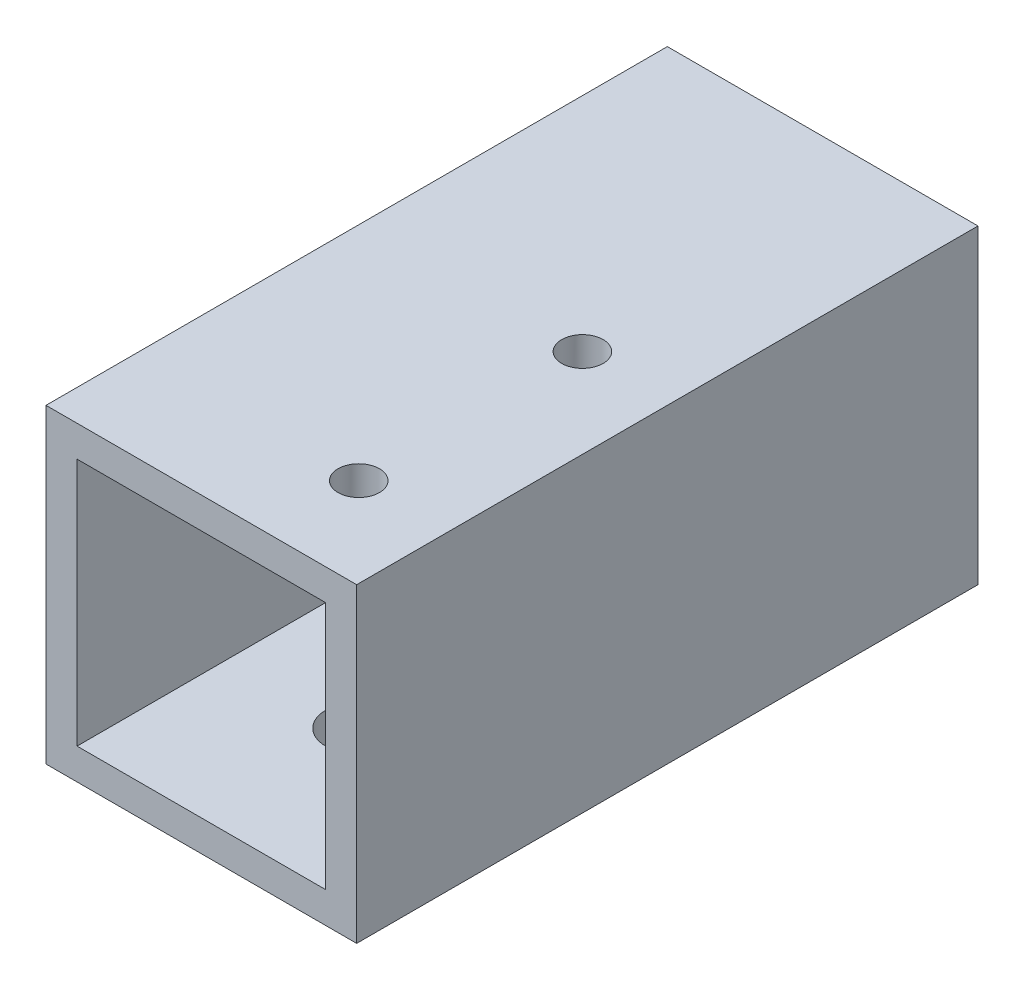
ISO-10303-21;
HEADER;
FILE_DESCRIPTION(('STEP AP214'),'2;1');
FILE_NAME('part.step','',(''),(''),'','','');
FILE_SCHEMA(('AUTOMOTIVE_DESIGN { 1 0 10303 214 1 1 1 1 }'));
ENDSEC;
DATA;
#1=APPLICATION_CONTEXT('core data for automotive mechanical design processes');
#2=APPLICATION_PROTOCOL_DEFINITION('international standard','automotive_design',2000,#1);
#3=PRODUCT_CONTEXT('',#1,'mechanical');
#4=PRODUCT('Part','Part','',(#3));
#5=PRODUCT_RELATED_PRODUCT_CATEGORY('part','',(#4));
#6=PRODUCT_DEFINITION_FORMATION('','',#4);
#7=PRODUCT_DEFINITION_CONTEXT('part definition',#1,'design');
#8=PRODUCT_DEFINITION('design','',#6,#7);
#9=PRODUCT_DEFINITION_SHAPE('','',#8);
#10=(LENGTH_UNIT() NAMED_UNIT(*) SI_UNIT(.MILLI.,.METRE.));
#11=(NAMED_UNIT(*) PLANE_ANGLE_UNIT() SI_UNIT($,.RADIAN.));
#12=(NAMED_UNIT(*) SI_UNIT($,.STERADIAN.) SOLID_ANGLE_UNIT());
#13=UNCERTAINTY_MEASURE_WITH_UNIT(LENGTH_MEASURE(1.E-05),#10,'distance_accuracy_value','');
#14=(GEOMETRIC_REPRESENTATION_CONTEXT(3) GLOBAL_UNCERTAINTY_ASSIGNED_CONTEXT((#13)) GLOBAL_UNIT_ASSIGNED_CONTEXT((#10,
#11,#12)) REPRESENTATION_CONTEXT('',''));
#15=CARTESIAN_POINT('',(0.,0.,0.));
#16=DIRECTION('',(0.,0.,1.));
#17=DIRECTION('',(1.,0.,0.));
#18=AXIS2_PLACEMENT_3D('',#15,#16,#17);
#19=CARTESIAN_POINT('',(0.,0.,30.));
#20=DIRECTION('',(0.,0.,1.));
#21=DIRECTION('',(1.,0.,0.));
#22=AXIS2_PLACEMENT_3D('',#19,#20,#21);
#23=PLANE('',#22);
#24=DIRECTION('',(0.,-1.,0.));
#25=VECTOR('',#24,1.);
#26=CARTESIAN_POINT('',(-7.01008414074451,7.73262608579252,30.));
#27=LINE('',#26,#25);
#28=CARTESIAN_POINT('',(-7.01008414074451,7.73262608579252,30.));
#29=VERTEX_POINT('',#28);
#30=CARTESIAN_POINT('',(-7.01008414074451,-7.26737391420748,30.));
#31=VERTEX_POINT('',#30);
#32=EDGE_CURVE('E138',#29,#31,#27,.T.);
#33=ORIENTED_EDGE('',*,*,#32,.T.);
#34=DIRECTION('',(1.,0.,0.));
#35=VECTOR('',#34,1.);
#36=CARTESIAN_POINT('',(-7.01008414074451,-7.26737391420748,30.));
#37=LINE('',#36,#35);
#38=CARTESIAN_POINT('',(7.98991585925548,-7.26737391420748,30.));
#39=VERTEX_POINT('',#38);
#40=EDGE_CURVE('E141',#31,#39,#37,.T.);
#41=ORIENTED_EDGE('',*,*,#40,.T.);
#42=DIRECTION('',(0.,1.,0.));
#43=VECTOR('',#42,1.);
#44=CARTESIAN_POINT('',(7.98991585925549,7.73262608579252,30.));
#45=LINE('',#44,#43);
#46=CARTESIAN_POINT('',(7.98991585925549,7.73262608579252,30.));
#47=VERTEX_POINT('',#46);
#48=EDGE_CURVE('E144',#39,#47,#45,.T.);
#49=ORIENTED_EDGE('',*,*,#48,.T.);
#50=DIRECTION('',(-1.,0.,0.));
#51=VECTOR('',#50,1.);
#52=CARTESIAN_POINT('',(-7.01008414074451,7.73262608579252,30.));
#53=LINE('',#52,#51);
#54=EDGE_CURVE('E146',#47,#29,#53,.T.);
#55=ORIENTED_EDGE('',*,*,#54,.T.);
#56=EDGE_LOOP('',(#33,#41,#49,#55));
#57=FACE_BOUND('',#56,.T.);
#58=DIRECTION('',(1.,0.,0.));
#59=VECTOR('',#58,1.);
#60=CARTESIAN_POINT('',(-5.51008414074451,-5.76737391420748,30.));
#61=LINE('',#60,#59);
#62=CARTESIAN_POINT('',(-5.51008414074451,-5.76737391420748,30.));
#63=VERTEX_POINT('',#62);
#64=CARTESIAN_POINT('',(6.48991585925549,-5.76737391420748,30.));
#65=VERTEX_POINT('',#64);
#66=EDGE_CURVE('E108',#63,#65,#61,.T.);
#67=ORIENTED_EDGE('',*,*,#66,.F.);
#68=DIRECTION('',(0.,-1.,0.));
#69=VECTOR('',#68,1.);
#70=CARTESIAN_POINT('',(-5.51008414074451,6.23262608579252,30.));
#71=LINE('',#70,#69);
#72=CARTESIAN_POINT('',(-5.51008414074451,6.23262608579252,30.));
#73=VERTEX_POINT('',#72);
#74=EDGE_CURVE('E100',#73,#63,#71,.T.);
#75=ORIENTED_EDGE('',*,*,#74,.F.);
#76=DIRECTION('',(-1.,0.,0.));
#77=VECTOR('',#76,1.);
#78=CARTESIAN_POINT('',(-5.51008414074451,6.23262608579252,30.));
#79=LINE('',#78,#77);
#80=CARTESIAN_POINT('',(6.48991585925549,6.23262608579252,30.));
#81=VERTEX_POINT('',#80);
#82=EDGE_CURVE('E122',#81,#73,#79,.T.);
#83=ORIENTED_EDGE('',*,*,#82,.F.);
#84=DIRECTION('',(0.,1.,0.));
#85=VECTOR('',#84,1.);
#86=CARTESIAN_POINT('',(6.48991585925549,6.23262608579252,30.));
#87=LINE('',#86,#85);
#88=EDGE_CURVE('E120',#65,#81,#87,.T.);
#89=ORIENTED_EDGE('',*,*,#88,.F.);
#90=EDGE_LOOP('',(#67,#75,#83,#89));
#91=FACE_BOUND('',#90,.T.);
#92=ADVANCED_FACE('F33',(#57,#91),#23,.T.);
#93=CARTESIAN_POINT('',(0.,0.,0.));
#94=DIRECTION('',(0.,0.,1.));
#95=DIRECTION('',(1.,0.,0.));
#96=AXIS2_PLACEMENT_3D('',#93,#94,#95);
#97=PLANE('',#96);
#98=DIRECTION('',(0.,-1.,0.));
#99=VECTOR('',#98,1.);
#100=CARTESIAN_POINT('',(-7.01008414074451,7.73262608579252,0.));
#101=LINE('',#100,#99);
#102=CARTESIAN_POINT('',(-7.01008414074451,7.73262608579252,0.));
#103=VERTEX_POINT('',#102);
#104=CARTESIAN_POINT('',(-7.01008414074451,-7.26737391420748,0.));
#105=VERTEX_POINT('',#104);
#106=EDGE_CURVE('E116',#103,#105,#101,.T.);
#107=ORIENTED_EDGE('',*,*,#106,.F.);
#108=DIRECTION('',(-1.,0.,0.));
#109=VECTOR('',#108,1.);
#110=CARTESIAN_POINT('',(-7.01008414074451,7.73262608579252,0.));
#111=LINE('',#110,#109);
#112=CARTESIAN_POINT('',(7.98991585925549,7.73262608579252,0.));
#113=VERTEX_POINT('',#112);
#114=EDGE_CURVE('E142',#113,#103,#111,.T.);
#115=ORIENTED_EDGE('',*,*,#114,.F.);
#116=DIRECTION('',(0.,1.,0.));
#117=VECTOR('',#116,1.);
#118=CARTESIAN_POINT('',(7.98991585925549,7.73262608579252,0.));
#119=LINE('',#118,#117);
#120=CARTESIAN_POINT('',(7.98991585925548,-7.26737391420748,0.));
#121=VERTEX_POINT('',#120);
#122=EDGE_CURVE('E153',#121,#113,#119,.T.);
#123=ORIENTED_EDGE('',*,*,#122,.F.);
#124=DIRECTION('',(1.,0.,0.));
#125=VECTOR('',#124,1.);
#126=CARTESIAN_POINT('',(-7.01008414074451,-7.26737391420748,0.));
#127=LINE('',#126,#125);
#128=EDGE_CURVE('E151',#105,#121,#127,.T.);
#129=ORIENTED_EDGE('',*,*,#128,.F.);
#130=EDGE_LOOP('',(#107,#115,#123,#129));
#131=FACE_BOUND('',#130,.T.);
#132=DIRECTION('',(0.,-1.,0.));
#133=VECTOR('',#132,1.);
#134=CARTESIAN_POINT('',(-5.51008414074451,6.23262608579252,0.));
#135=LINE('',#134,#133);
#136=CARTESIAN_POINT('',(-5.51008414074451,6.23262608579252,0.));
#137=VERTEX_POINT('',#136);
#138=CARTESIAN_POINT('',(-5.51008414074451,-5.76737391420748,0.));
#139=VERTEX_POINT('',#138);
#140=EDGE_CURVE('E58',#137,#139,#135,.T.);
#141=ORIENTED_EDGE('',*,*,#140,.T.);
#142=DIRECTION('',(1.,0.,0.));
#143=VECTOR('',#142,1.);
#144=CARTESIAN_POINT('',(-5.51008414074451,-5.76737391420748,0.));
#145=LINE('',#144,#143);
#146=CARTESIAN_POINT('',(6.48991585925549,-5.76737391420748,0.));
#147=VERTEX_POINT('',#146);
#148=EDGE_CURVE('E115',#139,#147,#145,.T.);
#149=ORIENTED_EDGE('',*,*,#148,.T.);
#150=DIRECTION('',(0.,1.,0.));
#151=VECTOR('',#150,1.);
#152=CARTESIAN_POINT('',(6.48991585925549,6.23262608579252,0.));
#153=LINE('',#152,#151);
#154=CARTESIAN_POINT('',(6.48991585925549,6.23262608579252,0.));
#155=VERTEX_POINT('',#154);
#156=EDGE_CURVE('E130',#147,#155,#153,.T.);
#157=ORIENTED_EDGE('',*,*,#156,.T.);
#158=DIRECTION('',(-1.,0.,0.));
#159=VECTOR('',#158,1.);
#160=CARTESIAN_POINT('',(-5.51008414074451,6.23262608579252,0.));
#161=LINE('',#160,#159);
#162=EDGE_CURVE('E109',#155,#137,#161,.T.);
#163=ORIENTED_EDGE('',*,*,#162,.T.);
#164=EDGE_LOOP('',(#141,#149,#157,#163));
#165=FACE_BOUND('',#164,.T.);
#166=ADVANCED_FACE('F205',(#131,#165),#97,.F.);
#167=CARTESIAN_POINT('',(-7.01008414074451,7.73262608579252,30.));
#168=DIRECTION('',(1.,0.,0.));
#169=DIRECTION('',(0.,1.,0.));
#170=AXIS2_PLACEMENT_3D('',#167,#168,#169);
#171=PLANE('',#170);
#172=CARTESIAN_POINT('',(-7.01008414074451,0.232626085792518,7.5));
#173=DIRECTION('',(-1.,0.,0.));
#174=DIRECTION('',(0.,-1.,0.));
#175=AXIS2_PLACEMENT_3D('',#172,#173,#174);
#176=CIRCLE('',#175,1.5);
#177=CARTESIAN_POINT('',(-7.01008414074451,-1.26737391420748,7.5));
#178=VERTEX_POINT('',#177);
#179=EDGE_CURVE('E171',#178,#178,#176,.T.);
#180=ORIENTED_EDGE('',*,*,#179,.F.);
#181=EDGE_LOOP('',(#180));
#182=FACE_BOUND('',#181,.T.);
#183=ORIENTED_EDGE('',*,*,#106,.T.);
#184=DIRECTION('',(0.,0.,-1.));
#185=VECTOR('',#184,1.);
#186=CARTESIAN_POINT('',(-7.01008414074451,-7.26737391420748,30.));
#187=LINE('',#186,#185);
#188=EDGE_CURVE('E11',#31,#105,#187,.T.);
#189=ORIENTED_EDGE('',*,*,#188,.F.);
#190=ORIENTED_EDGE('',*,*,#32,.F.);
#191=DIRECTION('',(0.,0.,-1.));
#192=VECTOR('',#191,1.);
#193=CARTESIAN_POINT('',(-7.01008414074451,7.73262608579252,30.));
#194=LINE('',#193,#192);
#195=EDGE_CURVE('E148',#29,#103,#194,.T.);
#196=ORIENTED_EDGE('',*,*,#195,.T.);
#197=EDGE_LOOP('',(#183,#189,#190,#196));
#198=FACE_BOUND('',#197,.T.);
#199=ADVANCED_FACE('F35',(#182,#198),#171,.F.);
#200=CARTESIAN_POINT('',(-7.01008414074451,-7.26737391420748,30.));
#201=DIRECTION('',(0.,1.,0.));
#202=DIRECTION('',(0.,0.,1.));
#203=AXIS2_PLACEMENT_3D('',#200,#201,#202);
#204=PLANE('',#203);
#205=CARTESIAN_POINT('',(0.489915859255484,-7.26737391420748,22.5));
#206=DIRECTION('',(0.,-1.,0.));
#207=DIRECTION('',(0.,0.,-1.));
#208=AXIS2_PLACEMENT_3D('',#205,#206,#207);
#209=CIRCLE('',#208,1.5);
#210=CARTESIAN_POINT('',(0.489915859255484,-7.26737391420748,21.));
#211=VERTEX_POINT('',#210);
#212=EDGE_CURVE('E180',#211,#211,#209,.T.);
#213=ORIENTED_EDGE('',*,*,#212,.F.);
#214=EDGE_LOOP('',(#213));
#215=FACE_BOUND('',#214,.T.);
#216=ORIENTED_EDGE('',*,*,#128,.T.);
#217=DIRECTION('',(0.,0.,-1.));
#218=VECTOR('',#217,1.);
#219=CARTESIAN_POINT('',(7.98991585925548,-7.26737391420748,30.));
#220=LINE('',#219,#218);
#221=EDGE_CURVE('E42',#39,#121,#220,.T.);
#222=ORIENTED_EDGE('',*,*,#221,.F.);
#223=ORIENTED_EDGE('',*,*,#40,.F.);
#224=ORIENTED_EDGE('',*,*,#188,.T.);
#225=EDGE_LOOP('',(#216,#222,#223,#224));
#226=FACE_BOUND('',#225,.T.);
#227=ADVANCED_FACE('F209',(#215,#226),#204,.F.);
#228=CARTESIAN_POINT('',(7.98991585925549,7.73262608579252,30.));
#229=DIRECTION('',(-1.,0.,0.));
#230=DIRECTION('',(0.,-1.,0.));
#231=AXIS2_PLACEMENT_3D('',#228,#229,#230);
#232=PLANE('',#231);
#233=ORIENTED_EDGE('',*,*,#122,.T.);
#234=DIRECTION('',(0.,0.,-1.));
#235=VECTOR('',#234,1.);
#236=CARTESIAN_POINT('',(7.98991585925549,7.73262608579252,30.));
#237=LINE('',#236,#235);
#238=EDGE_CURVE('E158',#47,#113,#237,.T.);
#239=ORIENTED_EDGE('',*,*,#238,.F.);
#240=ORIENTED_EDGE('',*,*,#48,.F.);
#241=ORIENTED_EDGE('',*,*,#221,.T.);
#242=EDGE_LOOP('',(#233,#239,#240,#241));
#243=FACE_BOUND('',#242,.T.);
#244=ADVANCED_FACE('F191',(#243),#232,.F.);
#245=CARTESIAN_POINT('',(-7.01008414074451,7.73262608579252,30.));
#246=DIRECTION('',(0.,-1.,0.));
#247=DIRECTION('',(0.,0.,-1.));
#248=AXIS2_PLACEMENT_3D('',#245,#246,#247);
#249=PLANE('',#248);
#250=CARTESIAN_POINT('',(3.68991585925549,7.73262608579252,25.6));
#251=DIRECTION('',(0.,1.,0.));
#252=DIRECTION('',(0.,0.,1.));
#253=AXIS2_PLACEMENT_3D('',#250,#251,#252);
#254=CIRCLE('',#253,1.);
#255=CARTESIAN_POINT('',(3.68991585925549,7.73262608579252,26.6));
#256=VERTEX_POINT('',#255);
#257=EDGE_CURVE('E166',#256,#256,#254,.T.);
#258=ORIENTED_EDGE('',*,*,#257,.F.);
#259=EDGE_LOOP('',(#258));
#260=FACE_BOUND('',#259,.T.);
#261=CARTESIAN_POINT('',(3.68991585925549,7.73262608579252,14.8));
#262=DIRECTION('',(0.,1.,0.));
#263=DIRECTION('',(0.,0.,1.));
#264=AXIS2_PLACEMENT_3D('',#261,#262,#263);
#265=CIRCLE('',#264,1.);
#266=CARTESIAN_POINT('',(3.68991585925549,7.73262608579252,15.8));
#267=VERTEX_POINT('',#266);
#268=EDGE_CURVE('E170',#267,#267,#265,.T.);
#269=ORIENTED_EDGE('',*,*,#268,.F.);
#270=EDGE_LOOP('',(#269));
#271=FACE_BOUND('',#270,.T.);
#272=ORIENTED_EDGE('',*,*,#114,.T.);
#273=ORIENTED_EDGE('',*,*,#195,.F.);
#274=ORIENTED_EDGE('',*,*,#54,.F.);
#275=ORIENTED_EDGE('',*,*,#238,.T.);
#276=EDGE_LOOP('',(#272,#273,#274,#275));
#277=FACE_BOUND('',#276,.T.);
#278=ADVANCED_FACE('F188',(#260,#271,#277),#249,.F.);
#279=CARTESIAN_POINT('',(-5.51008414074451,6.23262608579252,30.));
#280=DIRECTION('',(1.,0.,0.));
#281=DIRECTION('',(0.,1.,0.));
#282=AXIS2_PLACEMENT_3D('',#279,#280,#281);
#283=PLANE('',#282);
#284=CARTESIAN_POINT('',(-5.51008414074451,0.232626085792519,7.5));
#285=DIRECTION('',(1.,0.,0.));
#286=DIRECTION('',(0.,1.,0.));
#287=AXIS2_PLACEMENT_3D('',#284,#285,#286);
#288=CIRCLE('',#287,1.5);
#289=CARTESIAN_POINT('',(-5.51008414074451,1.73262608579252,7.5));
#290=VERTEX_POINT('',#289);
#291=EDGE_CURVE('E168',#290,#290,#288,.T.);
#292=ORIENTED_EDGE('',*,*,#291,.F.);
#293=EDGE_LOOP('',(#292));
#294=FACE_BOUND('',#293,.T.);
#295=ORIENTED_EDGE('',*,*,#140,.F.);
#296=DIRECTION('',(0.,0.,-1.));
#297=VECTOR('',#296,1.);
#298=CARTESIAN_POINT('',(-5.51008414074451,6.23262608579252,30.));
#299=LINE('',#298,#297);
#300=EDGE_CURVE('E104',#73,#137,#299,.T.);
#301=ORIENTED_EDGE('',*,*,#300,.F.);
#302=ORIENTED_EDGE('',*,*,#74,.T.);
#303=DIRECTION('',(0.,0.,-1.));
#304=VECTOR('',#303,1.);
#305=CARTESIAN_POINT('',(-5.51008414074451,-5.76737391420748,30.));
#306=LINE('',#305,#304);
#307=EDGE_CURVE('E103',#63,#139,#306,.T.);
#308=ORIENTED_EDGE('',*,*,#307,.T.);
#309=EDGE_LOOP('',(#295,#301,#302,#308));
#310=FACE_BOUND('',#309,.T.);
#311=ADVANCED_FACE('F102',(#294,#310),#283,.T.);
#312=CARTESIAN_POINT('',(-5.51008414074451,-5.76737391420748,30.));
#313=DIRECTION('',(0.,1.,0.));
#314=DIRECTION('',(0.,0.,1.));
#315=AXIS2_PLACEMENT_3D('',#312,#313,#314);
#316=PLANE('',#315);
#317=CARTESIAN_POINT('',(0.489915859255484,-5.76737391420748,22.5));
#318=DIRECTION('',(0.,1.,0.));
#319=DIRECTION('',(0.,0.,1.));
#320=AXIS2_PLACEMENT_3D('',#317,#318,#319);
#321=CIRCLE('',#320,1.5);
#322=CARTESIAN_POINT('',(0.489915859255484,-5.76737391420748,24.));
#323=VERTEX_POINT('',#322);
#324=EDGE_CURVE('E37',#323,#323,#321,.T.);
#325=ORIENTED_EDGE('',*,*,#324,.F.);
#326=EDGE_LOOP('',(#325));
#327=FACE_BOUND('',#326,.T.);
#328=ORIENTED_EDGE('',*,*,#148,.F.);
#329=ORIENTED_EDGE('',*,*,#307,.F.);
#330=ORIENTED_EDGE('',*,*,#66,.T.);
#331=DIRECTION('',(0.,0.,-1.));
#332=VECTOR('',#331,1.);
#333=CARTESIAN_POINT('',(6.48991585925549,-5.76737391420748,30.));
#334=LINE('',#333,#332);
#335=EDGE_CURVE('E117',#65,#147,#334,.T.);
#336=ORIENTED_EDGE('',*,*,#335,.T.);
#337=EDGE_LOOP('',(#328,#329,#330,#336));
#338=FACE_BOUND('',#337,.T.);
#339=ADVANCED_FACE('F112',(#327,#338),#316,.T.);
#340=CARTESIAN_POINT('',(6.48991585925549,6.23262608579252,30.));
#341=DIRECTION('',(-1.,0.,0.));
#342=DIRECTION('',(0.,-1.,0.));
#343=AXIS2_PLACEMENT_3D('',#340,#341,#342);
#344=PLANE('',#343);
#345=ORIENTED_EDGE('',*,*,#156,.F.);
#346=ORIENTED_EDGE('',*,*,#335,.F.);
#347=ORIENTED_EDGE('',*,*,#88,.T.);
#348=DIRECTION('',(0.,0.,-1.));
#349=VECTOR('',#348,1.);
#350=CARTESIAN_POINT('',(6.48991585925549,6.23262608579252,30.));
#351=LINE('',#350,#349);
#352=EDGE_CURVE('E50',#81,#155,#351,.T.);
#353=ORIENTED_EDGE('',*,*,#352,.T.);
#354=EDGE_LOOP('',(#345,#346,#347,#353));
#355=FACE_BOUND('',#354,.T.);
#356=ADVANCED_FACE('F231',(#355),#344,.T.);
#357=CARTESIAN_POINT('',(-5.51008414074451,6.23262608579252,30.));
#358=DIRECTION('',(0.,-1.,0.));
#359=DIRECTION('',(0.,0.,-1.));
#360=AXIS2_PLACEMENT_3D('',#357,#358,#359);
#361=PLANE('',#360);
#362=CARTESIAN_POINT('',(3.68991585925549,6.23262608579252,25.6));
#363=DIRECTION('',(0.,-1.,0.));
#364=DIRECTION('',(0.,0.,-1.));
#365=AXIS2_PLACEMENT_3D('',#362,#363,#364);
#366=CIRCLE('',#365,1.);
#367=CARTESIAN_POINT('',(3.68991585925549,6.23262608579252,24.6));
#368=VERTEX_POINT('',#367);
#369=EDGE_CURVE('E128',#368,#368,#366,.T.);
#370=ORIENTED_EDGE('',*,*,#369,.F.);
#371=EDGE_LOOP('',(#370));
#372=FACE_BOUND('',#371,.T.);
#373=CARTESIAN_POINT('',(3.68991585925549,6.23262608579252,14.8));
#374=DIRECTION('',(0.,-1.,0.));
#375=DIRECTION('',(0.,0.,-1.));
#376=AXIS2_PLACEMENT_3D('',#373,#374,#375);
#377=CIRCLE('',#376,1.);
#378=CARTESIAN_POINT('',(3.68991585925549,6.23262608579252,13.8));
#379=VERTEX_POINT('',#378);
#380=EDGE_CURVE('E163',#379,#379,#377,.T.);
#381=ORIENTED_EDGE('',*,*,#380,.F.);
#382=EDGE_LOOP('',(#381));
#383=FACE_BOUND('',#382,.T.);
#384=ORIENTED_EDGE('',*,*,#162,.F.);
#385=ORIENTED_EDGE('',*,*,#352,.F.);
#386=ORIENTED_EDGE('',*,*,#82,.T.);
#387=ORIENTED_EDGE('',*,*,#300,.T.);
#388=EDGE_LOOP('',(#384,#385,#386,#387));
#389=FACE_BOUND('',#388,.T.);
#390=ADVANCED_FACE('F235',(#372,#383,#389),#361,.T.);
#391=CARTESIAN_POINT('',(3.68991585925549,-2.26737391420748,14.8));
#392=DIRECTION('',(0.,1.,0.));
#393=DIRECTION('',(0.,0.,1.));
#394=AXIS2_PLACEMENT_3D('',#391,#392,#393);
#395=CYLINDRICAL_SURFACE('',#394,1.);
#396=ORIENTED_EDGE('',*,*,#380,.T.);
#397=EDGE_LOOP('',(#396));
#398=FACE_BOUND('',#397,.T.);
#399=ORIENTED_EDGE('',*,*,#268,.T.);
#400=EDGE_LOOP('',(#399));
#401=FACE_BOUND('',#400,.T.);
#402=ADVANCED_FACE('F239',(#398,#401),#395,.F.);
#403=CARTESIAN_POINT('',(3.68991585925549,-2.26737391420748,25.6));
#404=DIRECTION('',(0.,1.,0.));
#405=DIRECTION('',(0.,0.,1.));
#406=AXIS2_PLACEMENT_3D('',#403,#404,#405);
#407=CYLINDRICAL_SURFACE('',#406,1.);
#408=ORIENTED_EDGE('',*,*,#369,.T.);
#409=EDGE_LOOP('',(#408));
#410=FACE_BOUND('',#409,.T.);
#411=ORIENTED_EDGE('',*,*,#257,.T.);
#412=EDGE_LOOP('',(#411));
#413=FACE_BOUND('',#412,.T.);
#414=ADVANCED_FACE('F186',(#410,#413),#407,.F.);
#415=CARTESIAN_POINT('',(2.98991585925549,0.23262608579252,7.5));
#416=DIRECTION('',(-1.,0.,0.));
#417=DIRECTION('',(0.,-1.,0.));
#418=AXIS2_PLACEMENT_3D('',#415,#416,#417);
#419=CYLINDRICAL_SURFACE('',#418,1.5);
#420=ORIENTED_EDGE('',*,*,#291,.T.);
#421=EDGE_LOOP('',(#420));
#422=FACE_BOUND('',#421,.T.);
#423=ORIENTED_EDGE('',*,*,#179,.T.);
#424=EDGE_LOOP('',(#423));
#425=FACE_BOUND('',#424,.T.);
#426=ADVANCED_FACE('F246',(#422,#425),#419,.F.);
#427=CARTESIAN_POINT('',(0.489915859255484,2.73262608579252,22.5));
#428=DIRECTION('',(0.,-1.,0.));
#429=DIRECTION('',(0.,0.,-1.));
#430=AXIS2_PLACEMENT_3D('',#427,#428,#429);
#431=CYLINDRICAL_SURFACE('',#430,1.5);
#432=ORIENTED_EDGE('',*,*,#324,.T.);
#433=EDGE_LOOP('',(#432));
#434=FACE_BOUND('',#433,.T.);
#435=ORIENTED_EDGE('',*,*,#212,.T.);
#436=EDGE_LOOP('',(#435));
#437=FACE_BOUND('',#436,.T.);
#438=ADVANCED_FACE('F250',(#434,#437),#431,.F.);
#439=CLOSED_SHELL('',(#92,#166,#199,#227,#244,#278,#311,#339,#356,#390,#402,#414,#426,#438));
#440=MANIFOLD_SOLID_BREP('B2',#439);
#441=ADVANCED_BREP_SHAPE_REPRESENTATION('',(#18,#440),#14);
#442=SHAPE_DEFINITION_REPRESENTATION(#9,#441);
ENDSEC;
END-ISO-10303-21;
